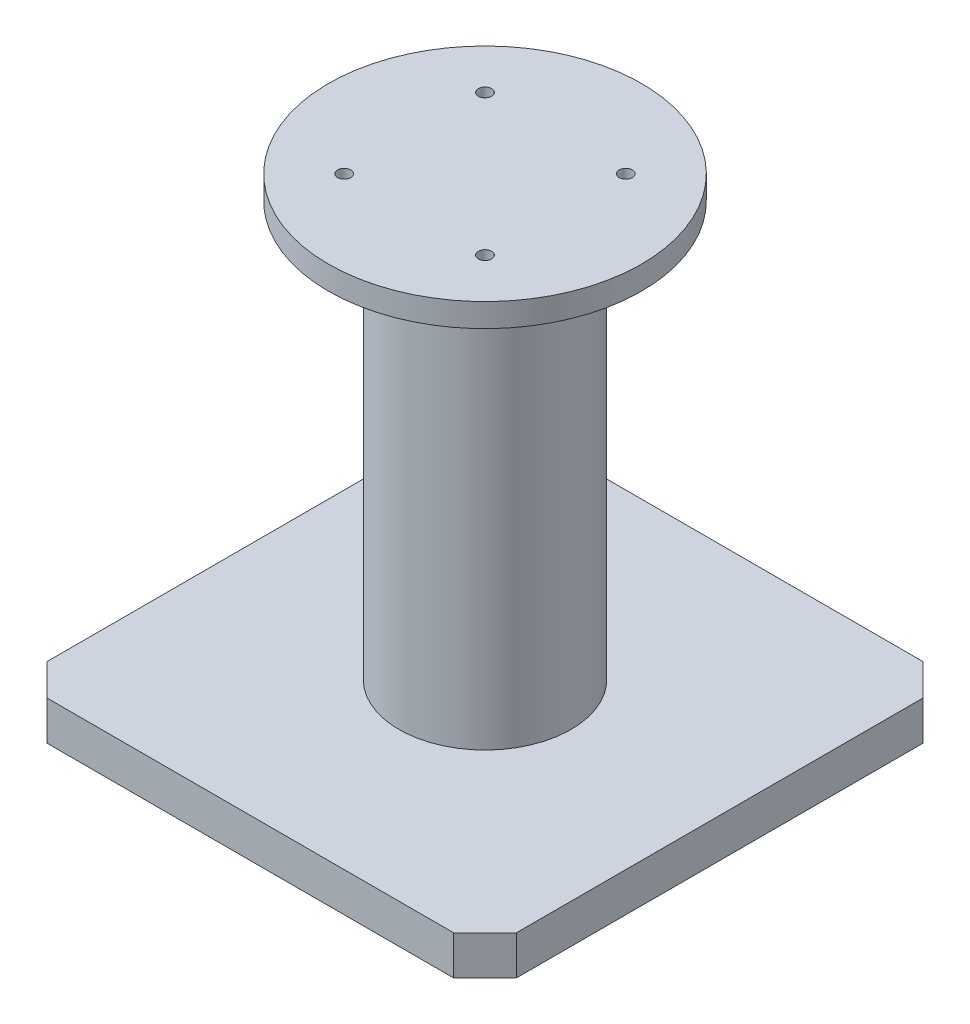
ISO-10303-21;
HEADER;
FILE_DESCRIPTION(('STEP AP214'),'2;1');
FILE_NAME('part.step','',(''),(''),'','','');
FILE_SCHEMA(('AUTOMOTIVE_DESIGN { 1 0 10303 214 1 1 1 1 }'));
ENDSEC;
DATA;
#1=APPLICATION_CONTEXT('core data for automotive mechanical design processes');
#2=APPLICATION_PROTOCOL_DEFINITION('international standard','automotive_design',2000,#1);
#3=PRODUCT_CONTEXT('',#1,'mechanical');
#4=PRODUCT('Part','Part','',(#3));
#5=PRODUCT_RELATED_PRODUCT_CATEGORY('part','',(#4));
#6=PRODUCT_DEFINITION_FORMATION('','',#4);
#7=PRODUCT_DEFINITION_CONTEXT('part definition',#1,'design');
#8=PRODUCT_DEFINITION('design','',#6,#7);
#9=PRODUCT_DEFINITION_SHAPE('','',#8);
#10=(LENGTH_UNIT() NAMED_UNIT(*) SI_UNIT(.MILLI.,.METRE.));
#11=(NAMED_UNIT(*) PLANE_ANGLE_UNIT() SI_UNIT($,.RADIAN.));
#12=(NAMED_UNIT(*) SI_UNIT($,.STERADIAN.) SOLID_ANGLE_UNIT());
#13=UNCERTAINTY_MEASURE_WITH_UNIT(LENGTH_MEASURE(1.E-05),#10,'distance_accuracy_value','');
#14=(GEOMETRIC_REPRESENTATION_CONTEXT(3) GLOBAL_UNCERTAINTY_ASSIGNED_CONTEXT((#13)) GLOBAL_UNIT_ASSIGNED_CONTEXT((#10,
#11,#12)) REPRESENTATION_CONTEXT('',''));
#15=CARTESIAN_POINT('',(0.,0.,0.));
#16=DIRECTION('',(0.,0.,1.));
#17=DIRECTION('',(1.,0.,0.));
#18=AXIS2_PLACEMENT_3D('',#15,#16,#17);
#19=CARTESIAN_POINT('',(0.,-15.,0.));
#20=DIRECTION('',(0.,1.,0.));
#21=DIRECTION('',(0.,0.,1.));
#22=AXIS2_PLACEMENT_3D('',#19,#20,#21);
#23=PLANE('',#22);
#24=CARTESIAN_POINT('',(45.,-15.,45.));
#25=DIRECTION('',(0.,1.,0.));
#26=DIRECTION('',(0.,0.,1.));
#27=AXIS2_PLACEMENT_3D('',#24,#25,#26);
#28=CIRCLE('',#27,4.25);
#29=CARTESIAN_POINT('',(45.,-15.,49.25));
#30=VERTEX_POINT('',#29);
#31=EDGE_CURVE('E276',#30,#30,#28,.T.);
#32=ORIENTED_EDGE('',*,*,#31,.T.);
#33=EDGE_LOOP('',(#32));
#34=FACE_BOUND('',#33,.T.);
#35=CARTESIAN_POINT('',(-45.,-15.,-45.));
#36=DIRECTION('',(0.,1.,0.));
#37=DIRECTION('',(0.,0.,1.));
#38=AXIS2_PLACEMENT_3D('',#35,#36,#37);
#39=CIRCLE('',#38,4.25);
#40=CARTESIAN_POINT('',(-45.,-15.,-40.75));
#41=VERTEX_POINT('',#40);
#42=EDGE_CURVE('E279',#41,#41,#39,.T.);
#43=ORIENTED_EDGE('',*,*,#42,.T.);
#44=EDGE_LOOP('',(#43));
#45=FACE_BOUND('',#44,.T.);
#46=CARTESIAN_POINT('',(0.,-15.,0.));
#47=DIRECTION('',(0.,-1.,0.));
#48=DIRECTION('',(0.,0.,-1.));
#49=AXIS2_PLACEMENT_3D('',#46,#47,#48);
#50=CIRCLE('',#49,55.);
#51=CARTESIAN_POINT('',(0.,-15.,-55.));
#52=VERTEX_POINT('',#51);
#53=EDGE_CURVE('E11',#52,#52,#50,.T.);
#54=ORIENTED_EDGE('',*,*,#53,.F.);
#55=EDGE_LOOP('',(#54));
#56=FACE_BOUND('',#55,.T.);
#57=CARTESIAN_POINT('',(0.,-15.,0.));
#58=DIRECTION('',(0.,1.,0.));
#59=DIRECTION('',(0.,0.,1.));
#60=AXIS2_PLACEMENT_3D('',#57,#58,#59);
#61=CIRCLE('',#60,100.);
#62=CARTESIAN_POINT('',(0.,-15.,100.));
#63=VERTEX_POINT('',#62);
#64=EDGE_CURVE('E52',#63,#63,#61,.T.);
#65=ORIENTED_EDGE('',*,*,#64,.F.);
#66=EDGE_LOOP('',(#65));
#67=FACE_BOUND('',#66,.T.);
#68=CARTESIAN_POINT('',(-45.,-15.,45.));
#69=DIRECTION('',(0.,1.,0.));
#70=DIRECTION('',(0.,0.,1.));
#71=AXIS2_PLACEMENT_3D('',#68,#69,#70);
#72=CIRCLE('',#71,4.25);
#73=CARTESIAN_POINT('',(-45.,-15.,49.25));
#74=VERTEX_POINT('',#73);
#75=EDGE_CURVE('E278',#74,#74,#72,.F.);
#76=ORIENTED_EDGE('',*,*,#75,.F.);
#77=EDGE_LOOP('',(#76));
#78=FACE_BOUND('',#77,.T.);
#79=CARTESIAN_POINT('',(45.,-15.,-45.));
#80=DIRECTION('',(0.,1.,0.));
#81=DIRECTION('',(0.,0.,1.));
#82=AXIS2_PLACEMENT_3D('',#79,#80,#81);
#83=CIRCLE('',#82,4.25);
#84=CARTESIAN_POINT('',(45.,-15.,-40.75));
#85=VERTEX_POINT('',#84);
#86=EDGE_CURVE('E151',#85,#85,#83,.F.);
#87=ORIENTED_EDGE('',*,*,#86,.F.);
#88=EDGE_LOOP('',(#87));
#89=FACE_BOUND('',#88,.T.);
#90=ADVANCED_FACE('F41',(#34,#45,#56,#67,#78,#89),#23,.F.);
#91=CARTESIAN_POINT('',(0.,0.,0.));
#92=DIRECTION('',(0.,1.,0.));
#93=DIRECTION('',(0.,0.,1.));
#94=AXIS2_PLACEMENT_3D('',#91,#92,#93);
#95=PLANE('',#94);
#96=CARTESIAN_POINT('',(-45.,0.,45.));
#97=DIRECTION('',(0.,-1.,0.));
#98=DIRECTION('',(0.,0.,-1.));
#99=AXIS2_PLACEMENT_3D('',#96,#97,#98);
#100=CIRCLE('',#99,4.25);
#101=CARTESIAN_POINT('',(-45.,0.,40.75));
#102=VERTEX_POINT('',#101);
#103=EDGE_CURVE('E321',#102,#102,#100,.T.);
#104=ORIENTED_EDGE('',*,*,#103,.T.);
#105=EDGE_LOOP('',(#104));
#106=FACE_BOUND('',#105,.T.);
#107=CARTESIAN_POINT('',(45.,0.,45.));
#108=DIRECTION('',(0.,1.,0.));
#109=DIRECTION('',(0.,0.,1.));
#110=AXIS2_PLACEMENT_3D('',#107,#108,#109);
#111=CIRCLE('',#110,4.25);
#112=CARTESIAN_POINT('',(45.,0.,49.25));
#113=VERTEX_POINT('',#112);
#114=EDGE_CURVE('E274',#113,#113,#111,.T.);
#115=ORIENTED_EDGE('',*,*,#114,.F.);
#116=EDGE_LOOP('',(#115));
#117=FACE_BOUND('',#116,.T.);
#118=CARTESIAN_POINT('',(-45.,0.,-45.));
#119=DIRECTION('',(0.,1.,0.));
#120=DIRECTION('',(0.,0.,1.));
#121=AXIS2_PLACEMENT_3D('',#118,#119,#120);
#122=CIRCLE('',#121,4.25);
#123=CARTESIAN_POINT('',(-45.,0.,-40.75));
#124=VERTEX_POINT('',#123);
#125=EDGE_CURVE('E286',#124,#124,#122,.T.);
#126=ORIENTED_EDGE('',*,*,#125,.F.);
#127=EDGE_LOOP('',(#126));
#128=FACE_BOUND('',#127,.T.);
#129=CARTESIAN_POINT('',(0.,0.,0.));
#130=DIRECTION('',(0.,1.,0.));
#131=DIRECTION('',(0.,0.,1.));
#132=AXIS2_PLACEMENT_3D('',#129,#130,#131);
#133=CIRCLE('',#132,100.);
#134=CARTESIAN_POINT('',(0.,0.,100.));
#135=VERTEX_POINT('',#134);
#136=EDGE_CURVE('E45',#135,#135,#133,.T.);
#137=ORIENTED_EDGE('',*,*,#136,.T.);
#138=EDGE_LOOP('',(#137));
#139=FACE_BOUND('',#138,.T.);
#140=CARTESIAN_POINT('',(45.,0.,-45.));
#141=DIRECTION('',(0.,-1.,0.));
#142=DIRECTION('',(0.,0.,-1.));
#143=AXIS2_PLACEMENT_3D('',#140,#141,#142);
#144=CIRCLE('',#143,4.25);
#145=CARTESIAN_POINT('',(45.,0.,-49.25));
#146=VERTEX_POINT('',#145);
#147=EDGE_CURVE('E320',#146,#146,#144,.T.);
#148=ORIENTED_EDGE('',*,*,#147,.T.);
#149=EDGE_LOOP('',(#148));
#150=FACE_BOUND('',#149,.T.);
#151=ADVANCED_FACE('F202',(#106,#117,#128,#139,#150),#95,.T.);
#152=CARTESIAN_POINT('',(0.,-15.,0.));
#153=DIRECTION('',(0.,1.,0.));
#154=DIRECTION('',(0.,0.,1.));
#155=AXIS2_PLACEMENT_3D('',#152,#153,#154);
#156=CYLINDRICAL_SURFACE('',#155,100.);
#157=ORIENTED_EDGE('',*,*,#64,.T.);
#158=EDGE_LOOP('',(#157));
#159=FACE_BOUND('',#158,.T.);
#160=ORIENTED_EDGE('',*,*,#136,.F.);
#161=EDGE_LOOP('',(#160));
#162=FACE_BOUND('',#161,.T.);
#163=ADVANCED_FACE('F43',(#159,#162),#156,.T.);
#164=CARTESIAN_POINT('',(0.,-280.,0.));
#165=DIRECTION('',(0.,1.,0.));
#166=DIRECTION('',(0.,0.,1.));
#167=AXIS2_PLACEMENT_3D('',#164,#165,#166);
#168=CYLINDRICAL_SURFACE('',#167,55.);
#169=CARTESIAN_POINT('',(0.,-280.,0.));
#170=DIRECTION('',(0.,-1.,0.));
#171=DIRECTION('',(0.,0.,-1.));
#172=AXIS2_PLACEMENT_3D('',#169,#170,#171);
#173=CIRCLE('',#172,55.);
#174=CARTESIAN_POINT('',(0.,-280.,-55.));
#175=VERTEX_POINT('',#174);
#176=EDGE_CURVE('E191',#175,#175,#173,.T.);
#177=ORIENTED_EDGE('',*,*,#176,.F.);
#178=EDGE_LOOP('',(#177));
#179=FACE_BOUND('',#178,.T.);
#180=ORIENTED_EDGE('',*,*,#53,.T.);
#181=EDGE_LOOP('',(#180));
#182=FACE_BOUND('',#181,.T.);
#183=ADVANCED_FACE('F206',(#179,#182),#168,.T.);
#184=CARTESIAN_POINT('',(-130.,-305.,150.));
#185=DIRECTION('',(0.,0.,-1.));
#186=DIRECTION('',(-1.,0.,0.));
#187=AXIS2_PLACEMENT_3D('',#184,#185,#186);
#188=PLANE('',#187);
#189=DIRECTION('',(-1.,0.,0.));
#190=VECTOR('',#189,1.);
#191=CARTESIAN_POINT('',(-130.,-280.,150.));
#192=LINE('',#191,#190);
#193=CARTESIAN_POINT('',(130.,-280.,150.));
#194=VERTEX_POINT('',#193);
#195=CARTESIAN_POINT('',(-130.,-280.,150.));
#196=VERTEX_POINT('',#195);
#197=EDGE_CURVE('E146',#194,#196,#192,.T.);
#198=ORIENTED_EDGE('',*,*,#197,.T.);
#199=DIRECTION('',(0.,1.,0.));
#200=VECTOR('',#199,1.);
#201=CARTESIAN_POINT('',(-130.,-305.,150.));
#202=LINE('',#201,#200);
#203=CARTESIAN_POINT('',(-130.,-305.,150.));
#204=VERTEX_POINT('',#203);
#205=EDGE_CURVE('E188',#204,#196,#202,.T.);
#206=ORIENTED_EDGE('',*,*,#205,.F.);
#207=DIRECTION('',(-1.,0.,0.));
#208=VECTOR('',#207,1.);
#209=CARTESIAN_POINT('',(-130.,-305.,150.));
#210=LINE('',#209,#208);
#211=CARTESIAN_POINT('',(130.,-305.,150.));
#212=VERTEX_POINT('',#211);
#213=EDGE_CURVE('E169',#212,#204,#210,.T.);
#214=ORIENTED_EDGE('',*,*,#213,.F.);
#215=DIRECTION('',(0.,1.,0.));
#216=VECTOR('',#215,1.);
#217=CARTESIAN_POINT('',(130.,-305.,150.));
#218=LINE('',#217,#216);
#219=EDGE_CURVE('E142',#212,#194,#218,.T.);
#220=ORIENTED_EDGE('',*,*,#219,.T.);
#221=EDGE_LOOP('',(#198,#206,#214,#220));
#222=FACE_BOUND('',#221,.T.);
#223=ADVANCED_FACE('F211',(#222),#188,.F.);
#224=CARTESIAN_POINT('',(-150.,-305.,130.));
#225=DIRECTION('',(0.707106781186547,0.,-0.707106781186547));
#226=DIRECTION('',(-0.707106781186548,0.,-0.707106781186548));
#227=AXIS2_PLACEMENT_3D('',#224,#225,#226);
#228=PLANE('',#227);
#229=DIRECTION('',(-0.707106781186547,0.,-0.707106781186547));
#230=VECTOR('',#229,1.);
#231=CARTESIAN_POINT('',(-150.,-280.,130.));
#232=LINE('',#231,#230);
#233=CARTESIAN_POINT('',(-150.,-280.,130.));
#234=VERTEX_POINT('',#233);
#235=EDGE_CURVE('E150',#196,#234,#232,.T.);
#236=ORIENTED_EDGE('',*,*,#235,.T.);
#237=DIRECTION('',(0.,1.,0.));
#238=VECTOR('',#237,1.);
#239=CARTESIAN_POINT('',(-150.,-305.,130.));
#240=LINE('',#239,#238);
#241=CARTESIAN_POINT('',(-150.,-305.,130.));
#242=VERTEX_POINT('',#241);
#243=EDGE_CURVE('E184',#242,#234,#240,.T.);
#244=ORIENTED_EDGE('',*,*,#243,.F.);
#245=DIRECTION('',(-0.707106781186547,0.,-0.707106781186547));
#246=VECTOR('',#245,1.);
#247=CARTESIAN_POINT('',(-150.,-305.,130.));
#248=LINE('',#247,#246);
#249=EDGE_CURVE('E105',#204,#242,#248,.T.);
#250=ORIENTED_EDGE('',*,*,#249,.F.);
#251=ORIENTED_EDGE('',*,*,#205,.T.);
#252=EDGE_LOOP('',(#236,#244,#250,#251));
#253=FACE_BOUND('',#252,.T.);
#254=ADVANCED_FACE('F225',(#253),#228,.F.);
#255=CARTESIAN_POINT('',(-150.,-305.,-130.));
#256=DIRECTION('',(1.,0.,0.));
#257=DIRECTION('',(0.,0.,-1.));
#258=AXIS2_PLACEMENT_3D('',#255,#256,#257);
#259=PLANE('',#258);
#260=DIRECTION('',(0.,0.,-1.));
#261=VECTOR('',#260,1.);
#262=CARTESIAN_POINT('',(-150.,-280.,-130.));
#263=LINE('',#262,#261);
#264=CARTESIAN_POINT('',(-150.,-280.,-130.));
#265=VERTEX_POINT('',#264);
#266=EDGE_CURVE('E154',#234,#265,#263,.T.);
#267=ORIENTED_EDGE('',*,*,#266,.T.);
#268=DIRECTION('',(0.,1.,0.));
#269=VECTOR('',#268,1.);
#270=CARTESIAN_POINT('',(-150.,-305.,-130.));
#271=LINE('',#270,#269);
#272=CARTESIAN_POINT('',(-150.,-305.,-130.));
#273=VERTEX_POINT('',#272);
#274=EDGE_CURVE('E180',#273,#265,#271,.T.);
#275=ORIENTED_EDGE('',*,*,#274,.F.);
#276=DIRECTION('',(0.,0.,-1.));
#277=VECTOR('',#276,1.);
#278=CARTESIAN_POINT('',(-150.,-305.,-130.));
#279=LINE('',#278,#277);
#280=EDGE_CURVE('E297',#242,#273,#279,.T.);
#281=ORIENTED_EDGE('',*,*,#280,.F.);
#282=ORIENTED_EDGE('',*,*,#243,.T.);
#283=EDGE_LOOP('',(#267,#275,#281,#282));
#284=FACE_BOUND('',#283,.T.);
#285=ADVANCED_FACE('F229',(#284),#259,.F.);
#286=CARTESIAN_POINT('',(-130.,-305.,-150.));
#287=DIRECTION('',(0.707106781186547,0.,0.707106781186547));
#288=DIRECTION('',(0.707106781186548,0.,-0.707106781186548));
#289=AXIS2_PLACEMENT_3D('',#286,#287,#288);
#290=PLANE('',#289);
#291=DIRECTION('',(0.707106781186547,0.,-0.707106781186547));
#292=VECTOR('',#291,1.);
#293=CARTESIAN_POINT('',(-130.,-280.,-150.));
#294=LINE('',#293,#292);
#295=CARTESIAN_POINT('',(-130.,-280.,-150.));
#296=VERTEX_POINT('',#295);
#297=EDGE_CURVE('E157',#265,#296,#294,.T.);
#298=ORIENTED_EDGE('',*,*,#297,.T.);
#299=DIRECTION('',(0.,1.,0.));
#300=VECTOR('',#299,1.);
#301=CARTESIAN_POINT('',(-130.,-305.,-150.));
#302=LINE('',#301,#300);
#303=CARTESIAN_POINT('',(-130.,-305.,-150.));
#304=VERTEX_POINT('',#303);
#305=EDGE_CURVE('E176',#304,#296,#302,.T.);
#306=ORIENTED_EDGE('',*,*,#305,.F.);
#307=DIRECTION('',(0.707106781186547,0.,-0.707106781186547));
#308=VECTOR('',#307,1.);
#309=CARTESIAN_POINT('',(-130.,-305.,-150.));
#310=LINE('',#309,#308);
#311=EDGE_CURVE('E300',#273,#304,#310,.T.);
#312=ORIENTED_EDGE('',*,*,#311,.F.);
#313=ORIENTED_EDGE('',*,*,#274,.T.);
#314=EDGE_LOOP('',(#298,#306,#312,#313));
#315=FACE_BOUND('',#314,.T.);
#316=ADVANCED_FACE('F232',(#315),#290,.F.);
#317=CARTESIAN_POINT('',(-130.,-305.,-150.));
#318=DIRECTION('',(0.,0.,1.));
#319=DIRECTION('',(1.,0.,0.));
#320=AXIS2_PLACEMENT_3D('',#317,#318,#319);
#321=PLANE('',#320);
#322=DIRECTION('',(1.,0.,0.));
#323=VECTOR('',#322,1.);
#324=CARTESIAN_POINT('',(-130.,-280.,-150.));
#325=LINE('',#324,#323);
#326=CARTESIAN_POINT('',(130.,-280.,-150.));
#327=VERTEX_POINT('',#326);
#328=EDGE_CURVE('E160',#296,#327,#325,.T.);
#329=ORIENTED_EDGE('',*,*,#328,.T.);
#330=DIRECTION('',(0.,1.,0.));
#331=VECTOR('',#330,1.);
#332=CARTESIAN_POINT('',(130.,-305.,-150.));
#333=LINE('',#332,#331);
#334=CARTESIAN_POINT('',(130.,-305.,-150.));
#335=VERTEX_POINT('',#334);
#336=EDGE_CURVE('E135',#335,#327,#333,.T.);
#337=ORIENTED_EDGE('',*,*,#336,.F.);
#338=DIRECTION('',(1.,0.,0.));
#339=VECTOR('',#338,1.);
#340=CARTESIAN_POINT('',(-130.,-305.,-150.));
#341=LINE('',#340,#339);
#342=EDGE_CURVE('E124',#304,#335,#341,.T.);
#343=ORIENTED_EDGE('',*,*,#342,.F.);
#344=ORIENTED_EDGE('',*,*,#305,.T.);
#345=EDGE_LOOP('',(#329,#337,#343,#344));
#346=FACE_BOUND('',#345,.T.);
#347=ADVANCED_FACE('F236',(#346),#321,.F.);
#348=CARTESIAN_POINT('',(130.,-305.,-150.));
#349=DIRECTION('',(-0.707106781186547,0.,0.707106781186547));
#350=DIRECTION('',(0.707106781186548,0.,0.707106781186548));
#351=AXIS2_PLACEMENT_3D('',#348,#349,#350);
#352=PLANE('',#351);
#353=DIRECTION('',(0.707106781186547,0.,0.707106781186547));
#354=VECTOR('',#353,1.);
#355=CARTESIAN_POINT('',(130.,-280.,-150.));
#356=LINE('',#355,#354);
#357=CARTESIAN_POINT('',(150.,-280.,-130.));
#358=VERTEX_POINT('',#357);
#359=EDGE_CURVE('E133',#327,#358,#356,.T.);
#360=ORIENTED_EDGE('',*,*,#359,.T.);
#361=DIRECTION('',(0.,1.,0.));
#362=VECTOR('',#361,1.);
#363=CARTESIAN_POINT('',(150.,-305.,-130.));
#364=LINE('',#363,#362);
#365=CARTESIAN_POINT('',(150.,-305.,-130.));
#366=VERTEX_POINT('',#365);
#367=EDGE_CURVE('E130',#366,#358,#364,.T.);
#368=ORIENTED_EDGE('',*,*,#367,.F.);
#369=DIRECTION('',(0.707106781186547,0.,0.707106781186547));
#370=VECTOR('',#369,1.);
#371=CARTESIAN_POINT('',(130.,-305.,-150.));
#372=LINE('',#371,#370);
#373=EDGE_CURVE('E118',#335,#366,#372,.T.);
#374=ORIENTED_EDGE('',*,*,#373,.F.);
#375=ORIENTED_EDGE('',*,*,#336,.T.);
#376=EDGE_LOOP('',(#360,#368,#374,#375));
#377=FACE_BOUND('',#376,.T.);
#378=ADVANCED_FACE('F131',(#377),#352,.F.);
#379=CARTESIAN_POINT('',(150.,-305.,-130.));
#380=DIRECTION('',(-1.,0.,0.));
#381=DIRECTION('',(0.,0.,1.));
#382=AXIS2_PLACEMENT_3D('',#379,#380,#381);
#383=PLANE('',#382);
#384=DIRECTION('',(0.,0.,1.));
#385=VECTOR('',#384,1.);
#386=CARTESIAN_POINT('',(150.,-280.,-130.));
#387=LINE('',#386,#385);
#388=CARTESIAN_POINT('',(150.,-280.,130.));
#389=VERTEX_POINT('',#388);
#390=EDGE_CURVE('E90',#358,#389,#387,.T.);
#391=ORIENTED_EDGE('',*,*,#390,.T.);
#392=DIRECTION('',(0.,1.,0.));
#393=VECTOR('',#392,1.);
#394=CARTESIAN_POINT('',(150.,-305.,130.));
#395=LINE('',#394,#393);
#396=CARTESIAN_POINT('',(150.,-305.,130.));
#397=VERTEX_POINT('',#396);
#398=EDGE_CURVE('E136',#397,#389,#395,.T.);
#399=ORIENTED_EDGE('',*,*,#398,.F.);
#400=DIRECTION('',(0.,0.,1.));
#401=VECTOR('',#400,1.);
#402=CARTESIAN_POINT('',(150.,-305.,-130.));
#403=LINE('',#402,#401);
#404=EDGE_CURVE('E122',#366,#397,#403,.T.);
#405=ORIENTED_EDGE('',*,*,#404,.F.);
#406=ORIENTED_EDGE('',*,*,#367,.T.);
#407=EDGE_LOOP('',(#391,#399,#405,#406));
#408=FACE_BOUND('',#407,.T.);
#409=ADVANCED_FACE('F138',(#408),#383,.F.);
#410=CARTESIAN_POINT('',(150.,-305.,130.));
#411=DIRECTION('',(-0.707106781186547,0.,-0.707106781186547));
#412=DIRECTION('',(-0.707106781186548,0.,0.707106781186548));
#413=AXIS2_PLACEMENT_3D('',#410,#411,#412);
#414=PLANE('',#413);
#415=DIRECTION('',(-0.707106781186547,0.,0.707106781186547));
#416=VECTOR('',#415,1.);
#417=CARTESIAN_POINT('',(150.,-280.,130.));
#418=LINE('',#417,#416);
#419=EDGE_CURVE('E96',#389,#194,#418,.T.);
#420=ORIENTED_EDGE('',*,*,#419,.T.);
#421=ORIENTED_EDGE('',*,*,#219,.F.);
#422=DIRECTION('',(-0.707106781186547,0.,0.707106781186547));
#423=VECTOR('',#422,1.);
#424=CARTESIAN_POINT('',(150.,-305.,130.));
#425=LINE('',#424,#423);
#426=EDGE_CURVE('E61',#397,#212,#425,.T.);
#427=ORIENTED_EDGE('',*,*,#426,.F.);
#428=ORIENTED_EDGE('',*,*,#398,.T.);
#429=EDGE_LOOP('',(#420,#421,#427,#428));
#430=FACE_BOUND('',#429,.T.);
#431=ADVANCED_FACE('F245',(#430),#414,.F.);
#432=CARTESIAN_POINT('',(0.,-305.,0.));
#433=DIRECTION('',(0.,-1.,0.));
#434=DIRECTION('',(0.,0.,-1.));
#435=AXIS2_PLACEMENT_3D('',#432,#433,#434);
#436=PLANE('',#435);
#437=ORIENTED_EDGE('',*,*,#213,.T.);
#438=ORIENTED_EDGE('',*,*,#249,.T.);
#439=ORIENTED_EDGE('',*,*,#280,.T.);
#440=ORIENTED_EDGE('',*,*,#311,.T.);
#441=ORIENTED_EDGE('',*,*,#342,.T.);
#442=ORIENTED_EDGE('',*,*,#373,.T.);
#443=ORIENTED_EDGE('',*,*,#404,.T.);
#444=ORIENTED_EDGE('',*,*,#426,.T.);
#445=EDGE_LOOP('',(#437,#438,#439,#440,#441,#442,#443,#444));
#446=FACE_BOUND('',#445,.T.);
#447=ADVANCED_FACE('F120',(#446),#436,.T.);
#448=CARTESIAN_POINT('',(0.,-280.,0.));
#449=DIRECTION('',(0.,-1.,0.));
#450=DIRECTION('',(0.,0.,-1.));
#451=AXIS2_PLACEMENT_3D('',#448,#449,#450);
#452=PLANE('',#451);
#453=ORIENTED_EDGE('',*,*,#176,.T.);
#454=EDGE_LOOP('',(#453));
#455=FACE_BOUND('',#454,.T.);
#456=ORIENTED_EDGE('',*,*,#197,.F.);
#457=ORIENTED_EDGE('',*,*,#419,.F.);
#458=ORIENTED_EDGE('',*,*,#390,.F.);
#459=ORIENTED_EDGE('',*,*,#359,.F.);
#460=ORIENTED_EDGE('',*,*,#328,.F.);
#461=ORIENTED_EDGE('',*,*,#297,.F.);
#462=ORIENTED_EDGE('',*,*,#266,.F.);
#463=ORIENTED_EDGE('',*,*,#235,.F.);
#464=EDGE_LOOP('',(#456,#457,#458,#459,#460,#461,#462,#463));
#465=FACE_BOUND('',#464,.T.);
#466=ADVANCED_FACE('F248',(#455,#465),#452,.F.);
#467=CARTESIAN_POINT('',(-45.,-25.,-45.));
#468=DIRECTION('',(0.,1.,0.));
#469=DIRECTION('',(0.,0.,1.));
#470=AXIS2_PLACEMENT_3D('',#467,#468,#469);
#471=CYLINDRICAL_SURFACE('',#470,4.25);
#472=ORIENTED_EDGE('',*,*,#125,.T.);
#473=EDGE_LOOP('',(#472));
#474=FACE_BOUND('',#473,.T.);
#475=ORIENTED_EDGE('',*,*,#42,.F.);
#476=EDGE_LOOP('',(#475));
#477=FACE_BOUND('',#476,.T.);
#478=ADVANCED_FACE('F251',(#474,#477),#471,.F.);
#479=CARTESIAN_POINT('',(45.,-25.,45.));
#480=DIRECTION('',(0.,1.,0.));
#481=DIRECTION('',(0.,0.,1.));
#482=AXIS2_PLACEMENT_3D('',#479,#480,#481);
#483=CYLINDRICAL_SURFACE('',#482,4.25);
#484=ORIENTED_EDGE('',*,*,#114,.T.);
#485=EDGE_LOOP('',(#484));
#486=FACE_BOUND('',#485,.T.);
#487=ORIENTED_EDGE('',*,*,#31,.F.);
#488=EDGE_LOOP('',(#487));
#489=FACE_BOUND('',#488,.T.);
#490=ADVANCED_FACE('F257',(#486,#489),#483,.F.);
#491=CARTESIAN_POINT('',(-45.,-25.,45.));
#492=DIRECTION('',(0.,1.,0.));
#493=DIRECTION('',(0.,0.,1.));
#494=AXIS2_PLACEMENT_3D('',#491,#492,#493);
#495=CYLINDRICAL_SURFACE('',#494,4.25);
#496=ORIENTED_EDGE('',*,*,#103,.F.);
#497=EDGE_LOOP('',(#496));
#498=FACE_BOUND('',#497,.T.);
#499=ORIENTED_EDGE('',*,*,#75,.T.);
#500=EDGE_LOOP('',(#499));
#501=FACE_BOUND('',#500,.T.);
#502=ADVANCED_FACE('F259',(#498,#501),#495,.F.);
#503=CARTESIAN_POINT('',(45.,-25.,-45.));
#504=DIRECTION('',(0.,1.,0.));
#505=DIRECTION('',(0.,0.,1.));
#506=AXIS2_PLACEMENT_3D('',#503,#504,#505);
#507=CYLINDRICAL_SURFACE('',#506,4.25);
#508=ORIENTED_EDGE('',*,*,#147,.F.);
#509=EDGE_LOOP('',(#508));
#510=FACE_BOUND('',#509,.T.);
#511=ORIENTED_EDGE('',*,*,#86,.T.);
#512=EDGE_LOOP('',(#511));
#513=FACE_BOUND('',#512,.T.);
#514=ADVANCED_FACE('F262',(#510,#513),#507,.F.);
#515=CLOSED_SHELL('',(#90,#151,#163,#183,#223,#254,#285,#316,#347,#378,#409,#431,#447,#466,#478,
#490,#502,#514));
#516=MANIFOLD_SOLID_BREP('B2',#515);
#517=ADVANCED_BREP_SHAPE_REPRESENTATION('',(#18,#516),#14);
#518=SHAPE_DEFINITION_REPRESENTATION(#9,#517);
ENDSEC;
END-ISO-10303-21;
